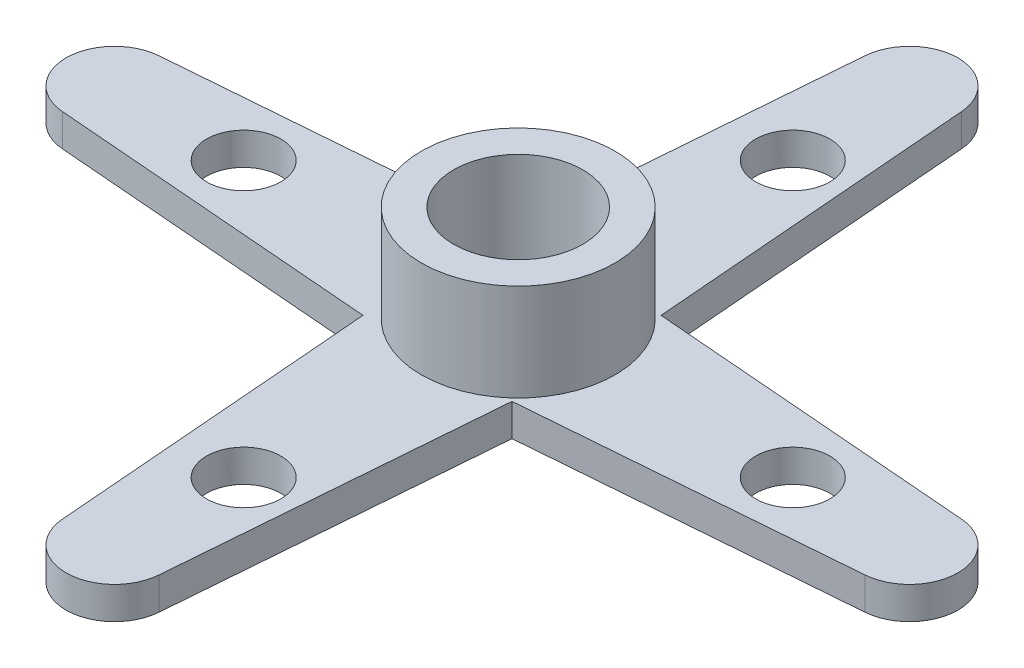
ISO-10303-21;
HEADER;
FILE_DESCRIPTION(('STEP AP214'),'2;1');
FILE_NAME('part.step','',(''),(''),'','','');
FILE_SCHEMA(('AUTOMOTIVE_DESIGN { 1 0 10303 214 1 1 1 1 }'));
ENDSEC;
DATA;
#1=APPLICATION_CONTEXT('core data for automotive mechanical design processes');
#2=APPLICATION_PROTOCOL_DEFINITION('international standard','automotive_design',2000,#1);
#3=PRODUCT_CONTEXT('',#1,'mechanical');
#4=PRODUCT('Part','Part','',(#3));
#5=PRODUCT_RELATED_PRODUCT_CATEGORY('part','',(#4));
#6=PRODUCT_DEFINITION_FORMATION('','',#4);
#7=PRODUCT_DEFINITION_CONTEXT('part definition',#1,'design');
#8=PRODUCT_DEFINITION('design','',#6,#7);
#9=PRODUCT_DEFINITION_SHAPE('','',#8);
#10=(LENGTH_UNIT() NAMED_UNIT(*) SI_UNIT(.MILLI.,.METRE.));
#11=(NAMED_UNIT(*) PLANE_ANGLE_UNIT() SI_UNIT($,.RADIAN.));
#12=(NAMED_UNIT(*) SI_UNIT($,.STERADIAN.) SOLID_ANGLE_UNIT());
#13=UNCERTAINTY_MEASURE_WITH_UNIT(LENGTH_MEASURE(1.E-05),#10,'distance_accuracy_value','');
#14=(GEOMETRIC_REPRESENTATION_CONTEXT(3) GLOBAL_UNCERTAINTY_ASSIGNED_CONTEXT((#13)) GLOBAL_UNIT_ASSIGNED_CONTEXT((#10,
#11,#12)) REPRESENTATION_CONTEXT('',''));
#15=CARTESIAN_POINT('',(0.,0.,0.));
#16=DIRECTION('',(0.,0.,1.));
#17=DIRECTION('',(1.,0.,0.));
#18=AXIS2_PLACEMENT_3D('',#15,#16,#17);
#19=CARTESIAN_POINT('',(-12.5,1.,0.));
#20=DIRECTION('',(0.,1.,0.));
#21=DIRECTION('',(0.,0.,1.));
#22=AXIS2_PLACEMENT_3D('',#19,#20,#21);
#23=PLANE('',#22);
#24=CARTESIAN_POINT('',(0.,1.,8.5));
#25=DIRECTION('',(0.,1.,0.));
#26=DIRECTION('',(-1.,0.,0.));
#27=AXIS2_PLACEMENT_3D('',#24,#25,#26);
#28=CIRCLE('',#27,1.15);
#29=CARTESIAN_POINT('',(-1.15000000000003,1.,8.5));
#30=VERTEX_POINT('',#29);
#31=EDGE_CURVE('E228',#30,#30,#28,.T.);
#32=ORIENTED_EDGE('',*,*,#31,.F.);
#33=EDGE_LOOP('',(#32));
#34=FACE_BOUND('',#33,.T.);
#35=CARTESIAN_POINT('',(0.,1.,-8.5));
#36=DIRECTION('',(0.,1.,0.));
#37=DIRECTION('',(-1.,0.,0.));
#38=AXIS2_PLACEMENT_3D('',#35,#36,#37);
#39=CIRCLE('',#38,1.15);
#40=CARTESIAN_POINT('',(-1.14999999999997,1.,-8.5));
#41=VERTEX_POINT('',#40);
#42=EDGE_CURVE('E217',#41,#41,#39,.T.);
#43=ORIENTED_EDGE('',*,*,#42,.F.);
#44=EDGE_LOOP('',(#43));
#45=FACE_BOUND('',#44,.T.);
#46=CARTESIAN_POINT('',(-12.5,1.,0.));
#47=DIRECTION('',(0.,1.,0.));
#48=DIRECTION('',(0.,0.,1.));
#49=AXIS2_PLACEMENT_3D('',#46,#47,#48);
#50=CIRCLE('',#49,1.5);
#51=CARTESIAN_POINT('',(-12.62,1.,-1.49519229532525));
#52=VERTEX_POINT('',#51);
#53=CARTESIAN_POINT('',(-12.62,1.,1.49519229532525));
#54=VERTEX_POINT('',#53);
#55=EDGE_CURVE('E183',#52,#54,#50,.T.);
#56=ORIENTED_EDGE('',*,*,#55,.T.);
#57=DIRECTION('',(0.996794863550168,0.,0.0800000000000099));
#58=VECTOR('',#57,1.);
#59=CARTESIAN_POINT('',(-12.62,1.,1.49519229532525));
#60=LINE('',#59,#58);
#61=CARTESIAN_POINT('',(-2.50000000000066,1.,2.30739551747729));
#62=VERTEX_POINT('',#61);
#63=EDGE_CURVE('E111',#54,#62,#60,.T.);
#64=ORIENTED_EDGE('',*,*,#63,.T.);
#65=DIRECTION('',(0.0800000000000088,0.,0.996794863550168));
#66=VECTOR('',#65,1.);
#67=CARTESIAN_POINT('',(-1.68779677784863,1.,12.4273955174766));
#68=LINE('',#67,#66);
#69=CARTESIAN_POINT('',(-1.68779677784863,1.,12.4273955174766));
#70=VERTEX_POINT('',#69);
#71=EDGE_CURVE('E244',#62,#70,#68,.T.);
#72=ORIENTED_EDGE('',*,*,#71,.T.);
#73=CARTESIAN_POINT('',(-0.192604482523366,1.,12.3073955174766));
#74=DIRECTION('',(0.,1.,0.));
#75=DIRECTION('',(0.,0.,1.));
#76=AXIS2_PLACEMENT_3D('',#73,#74,#75);
#77=CIRCLE('',#76,1.50000000000002);
#78=CARTESIAN_POINT('',(1.30258781280191,1.,12.4273955174766));
#79=VERTEX_POINT('',#78);
#80=EDGE_CURVE('E246',#70,#79,#77,.T.);
#81=ORIENTED_EDGE('',*,*,#80,.T.);
#82=DIRECTION('',(0.0800000000000076,0.,-0.996794863550168));
#83=VECTOR('',#82,1.);
#84=CARTESIAN_POINT('',(1.30258781280191,1.,12.4273955174766));
#85=LINE('',#84,#83);
#86=CARTESIAN_POINT('',(2.11479103495392,1.,2.30739551747729));
#87=VERTEX_POINT('',#86);
#88=EDGE_CURVE('E248',#79,#87,#85,.T.);
#89=ORIENTED_EDGE('',*,*,#88,.T.);
#90=DIRECTION('',(0.996794863550168,0.,-0.0800000000000086));
#91=VECTOR('',#90,1.);
#92=CARTESIAN_POINT('',(12.2347910349533,1.,1.49519229532526));
#93=LINE('',#92,#91);
#94=CARTESIAN_POINT('',(12.2347910349533,1.,1.49519229532527));
#95=VERTEX_POINT('',#94);
#96=EDGE_CURVE('E250',#87,#95,#93,.T.);
#97=ORIENTED_EDGE('',*,*,#96,.T.);
#98=CARTESIAN_POINT('',(12.1147910349533,1.,0.));
#99=DIRECTION('',(0.,1.,0.));
#100=DIRECTION('',(0.,0.,1.));
#101=AXIS2_PLACEMENT_3D('',#98,#99,#100);
#102=CIRCLE('',#101,1.50000000000002);
#103=CARTESIAN_POINT('',(12.2347910349533,1.,-1.49519229532528));
#104=VERTEX_POINT('',#103);
#105=EDGE_CURVE('E252',#95,#104,#102,.T.);
#106=ORIENTED_EDGE('',*,*,#105,.T.);
#107=DIRECTION('',(-0.996794863550168,0.,-0.0800000000000077));
#108=VECTOR('',#107,1.);
#109=CARTESIAN_POINT('',(12.2347910349533,1.,-1.49519229532528));
#110=LINE('',#109,#108);
#111=CARTESIAN_POINT('',(2.11479103495392,1.,-2.30739551747729));
#112=VERTEX_POINT('',#111);
#113=EDGE_CURVE('E254',#104,#112,#110,.T.);
#114=ORIENTED_EDGE('',*,*,#113,.T.);
#115=DIRECTION('',(-0.0800000000000085,0.,-0.996794863550168));
#116=VECTOR('',#115,1.);
#117=CARTESIAN_POINT('',(1.30258781280189,1.,-12.4273955174766));
#118=LINE('',#117,#116);
#119=CARTESIAN_POINT('',(1.3025878128019,1.,-12.4273955174766));
#120=VERTEX_POINT('',#119);
#121=EDGE_CURVE('E142',#112,#120,#118,.T.);
#122=ORIENTED_EDGE('',*,*,#121,.T.);
#123=CARTESIAN_POINT('',(-0.19260448252337,1.,-12.3073955174766));
#124=DIRECTION('',(0.,1.,0.));
#125=DIRECTION('',(0.,0.,1.));
#126=AXIS2_PLACEMENT_3D('',#123,#124,#125);
#127=CIRCLE('',#126,1.50000000000002);
#128=CARTESIAN_POINT('',(-1.68779677784864,1.,-12.4273955174766));
#129=VERTEX_POINT('',#128);
#130=EDGE_CURVE('E136',#120,#129,#127,.T.);
#131=ORIENTED_EDGE('',*,*,#130,.T.);
#132=DIRECTION('',(-0.0800000000000077,0.,0.996794863550168));
#133=VECTOR('',#132,1.);
#134=CARTESIAN_POINT('',(-1.68779677784864,1.,-12.4273955174766));
#135=LINE('',#134,#133);
#136=CARTESIAN_POINT('',(-2.50000000000066,1.,-2.30739551747729));
#137=VERTEX_POINT('',#136);
#138=EDGE_CURVE('E140',#129,#137,#135,.T.);
#139=ORIENTED_EDGE('',*,*,#138,.T.);
#140=DIRECTION('',(-0.996794863550168,0.,0.0800000000000097));
#141=VECTOR('',#140,1.);
#142=CARTESIAN_POINT('',(-12.62,1.,-1.49519229532525));
#143=LINE('',#142,#141);
#144=EDGE_CURVE('E56',#137,#52,#143,.T.);
#145=ORIENTED_EDGE('',*,*,#144,.T.);
#146=EDGE_LOOP('',(#56,#64,#72,#81,#89,#97,#106,#114,#122,#131,#139,#145));
#147=FACE_BOUND('',#146,.T.);
#148=CARTESIAN_POINT('',(-8.5,1.,0.));
#149=DIRECTION('',(0.,1.,0.));
#150=DIRECTION('',(0.,0.,1.));
#151=AXIS2_PLACEMENT_3D('',#148,#149,#150);
#152=CIRCLE('',#151,1.15);
#153=CARTESIAN_POINT('',(-8.5,1.,1.15));
#154=VERTEX_POINT('',#153);
#155=EDGE_CURVE('E210',#154,#154,#152,.T.);
#156=ORIENTED_EDGE('',*,*,#155,.F.);
#157=EDGE_LOOP('',(#156));
#158=FACE_BOUND('',#157,.T.);
#159=CARTESIAN_POINT('',(8.5,1.,0.));
#160=DIRECTION('',(0.,1.,0.));
#161=DIRECTION('',(0.,0.,1.));
#162=AXIS2_PLACEMENT_3D('',#159,#160,#161);
#163=CIRCLE('',#162,1.15);
#164=CARTESIAN_POINT('',(8.5,1.,1.15));
#165=VERTEX_POINT('',#164);
#166=EDGE_CURVE('E213',#165,#165,#163,.T.);
#167=ORIENTED_EDGE('',*,*,#166,.F.);
#168=EDGE_LOOP('',(#167));
#169=FACE_BOUND('',#168,.T.);
#170=CARTESIAN_POINT('',(0.,1.,0.));
#171=DIRECTION('',(0.,1.,0.));
#172=DIRECTION('',(0.,0.,1.));
#173=AXIS2_PLACEMENT_3D('',#170,#171,#172);
#174=CIRCLE('',#173,3.);
#175=CARTESIAN_POINT('',(0.,1.,3.));
#176=VERTEX_POINT('',#175);
#177=EDGE_CURVE('E221',#176,#176,#174,.T.);
#178=ORIENTED_EDGE('',*,*,#177,.F.);
#179=EDGE_LOOP('',(#178));
#180=FACE_BOUND('',#179,.T.);
#181=ADVANCED_FACE('F37',(#34,#45,#147,#158,#169,#180),#23,.T.);
#182=CARTESIAN_POINT('',(-12.5,0.,0.));
#183=DIRECTION('',(0.,1.,0.));
#184=DIRECTION('',(0.,0.,1.));
#185=AXIS2_PLACEMENT_3D('',#182,#183,#184);
#186=PLANE('',#185);
#187=CARTESIAN_POINT('',(0.,0.,8.5));
#188=DIRECTION('',(0.,1.,0.));
#189=DIRECTION('',(0.,0.,1.));
#190=AXIS2_PLACEMENT_3D('',#187,#188,#189);
#191=CIRCLE('',#190,1.15);
#192=CARTESIAN_POINT('',(0.,0.,9.65));
#193=VERTEX_POINT('',#192);
#194=EDGE_CURVE('E41',#193,#193,#191,.T.);
#195=ORIENTED_EDGE('',*,*,#194,.T.);
#196=EDGE_LOOP('',(#195));
#197=FACE_BOUND('',#196,.T.);
#198=CARTESIAN_POINT('',(0.,0.,-8.5));
#199=DIRECTION('',(0.,1.,0.));
#200=DIRECTION('',(0.,0.,1.));
#201=AXIS2_PLACEMENT_3D('',#198,#199,#200);
#202=CIRCLE('',#201,1.15);
#203=CARTESIAN_POINT('',(0.,0.,-7.35));
#204=VERTEX_POINT('',#203);
#205=EDGE_CURVE('E214',#204,#204,#202,.T.);
#206=ORIENTED_EDGE('',*,*,#205,.T.);
#207=EDGE_LOOP('',(#206));
#208=FACE_BOUND('',#207,.T.);
#209=CARTESIAN_POINT('',(8.5,0.,0.));
#210=DIRECTION('',(0.,1.,0.));
#211=DIRECTION('',(0.,0.,1.));
#212=AXIS2_PLACEMENT_3D('',#209,#210,#211);
#213=CIRCLE('',#212,1.15);
#214=CARTESIAN_POINT('',(8.5,0.,1.15));
#215=VERTEX_POINT('',#214);
#216=EDGE_CURVE('E211',#215,#215,#213,.T.);
#217=ORIENTED_EDGE('',*,*,#216,.T.);
#218=EDGE_LOOP('',(#217));
#219=FACE_BOUND('',#218,.T.);
#220=CARTESIAN_POINT('',(-8.5,0.,0.));
#221=DIRECTION('',(0.,1.,0.));
#222=DIRECTION('',(0.,0.,1.));
#223=AXIS2_PLACEMENT_3D('',#220,#221,#222);
#224=CIRCLE('',#223,1.15);
#225=CARTESIAN_POINT('',(-8.5,0.,1.15));
#226=VERTEX_POINT('',#225);
#227=EDGE_CURVE('E207',#226,#226,#224,.T.);
#228=ORIENTED_EDGE('',*,*,#227,.T.);
#229=EDGE_LOOP('',(#228));
#230=FACE_BOUND('',#229,.T.);
#231=CARTESIAN_POINT('',(-12.5,0.,0.));
#232=DIRECTION('',(0.,1.,0.));
#233=DIRECTION('',(0.,0.,1.));
#234=AXIS2_PLACEMENT_3D('',#231,#232,#233);
#235=CIRCLE('',#234,1.5);
#236=CARTESIAN_POINT('',(-12.62,0.,-1.49519229532525));
#237=VERTEX_POINT('',#236);
#238=CARTESIAN_POINT('',(-12.62,0.,1.49519229532525));
#239=VERTEX_POINT('',#238);
#240=EDGE_CURVE('E160',#237,#239,#235,.T.);
#241=ORIENTED_EDGE('',*,*,#240,.F.);
#242=DIRECTION('',(-0.996794863550168,0.,0.0800000000000097));
#243=VECTOR('',#242,1.);
#244=CARTESIAN_POINT('',(-12.62,0.,-1.49519229532525));
#245=LINE('',#244,#243);
#246=CARTESIAN_POINT('',(-2.50000000000066,0.,-2.30739551747729));
#247=VERTEX_POINT('',#246);
#248=EDGE_CURVE('E103',#247,#237,#245,.T.);
#249=ORIENTED_EDGE('',*,*,#248,.F.);
#250=DIRECTION('',(-0.0800000000000077,0.,0.996794863550168));
#251=VECTOR('',#250,1.);
#252=CARTESIAN_POINT('',(-1.68779677784864,0.,-12.4273955174766));
#253=LINE('',#252,#251);
#254=CARTESIAN_POINT('',(-1.68779677784864,0.,-12.4273955174766));
#255=VERTEX_POINT('',#254);
#256=EDGE_CURVE('E97',#255,#247,#253,.T.);
#257=ORIENTED_EDGE('',*,*,#256,.F.);
#258=CARTESIAN_POINT('',(-0.19260448252337,0.,-12.3073955174766));
#259=DIRECTION('',(0.,1.,0.));
#260=DIRECTION('',(0.,0.,1.));
#261=AXIS2_PLACEMENT_3D('',#258,#259,#260);
#262=CIRCLE('',#261,1.50000000000002);
#263=CARTESIAN_POINT('',(1.3025878128019,0.,-12.4273955174766));
#264=VERTEX_POINT('',#263);
#265=EDGE_CURVE('E150',#264,#255,#262,.T.);
#266=ORIENTED_EDGE('',*,*,#265,.F.);
#267=DIRECTION('',(-0.0800000000000085,0.,-0.996794863550168));
#268=VECTOR('',#267,1.);
#269=CARTESIAN_POINT('',(1.30258781280189,0.,-12.4273955174766));
#270=LINE('',#269,#268);
#271=CARTESIAN_POINT('',(2.11479103495392,0.,-2.30739551747729));
#272=VERTEX_POINT('',#271);
#273=EDGE_CURVE('E178',#272,#264,#270,.T.);
#274=ORIENTED_EDGE('',*,*,#273,.F.);
#275=DIRECTION('',(-0.996794863550168,0.,-0.0800000000000077));
#276=VECTOR('',#275,1.);
#277=CARTESIAN_POINT('',(12.2347910349533,0.,-1.49519229532528));
#278=LINE('',#277,#276);
#279=CARTESIAN_POINT('',(12.2347910349533,0.,-1.49519229532528));
#280=VERTEX_POINT('',#279);
#281=EDGE_CURVE('E176',#280,#272,#278,.T.);
#282=ORIENTED_EDGE('',*,*,#281,.F.);
#283=CARTESIAN_POINT('',(12.1147910349533,0.,0.));
#284=DIRECTION('',(0.,1.,0.));
#285=DIRECTION('',(0.,0.,1.));
#286=AXIS2_PLACEMENT_3D('',#283,#284,#285);
#287=CIRCLE('',#286,1.50000000000002);
#288=CARTESIAN_POINT('',(12.2347910349533,0.,1.49519229532527));
#289=VERTEX_POINT('',#288);
#290=EDGE_CURVE('E174',#289,#280,#287,.T.);
#291=ORIENTED_EDGE('',*,*,#290,.F.);
#292=DIRECTION('',(0.996794863550168,0.,-0.0800000000000086));
#293=VECTOR('',#292,1.);
#294=CARTESIAN_POINT('',(12.2347910349533,0.,1.49519229532526));
#295=LINE('',#294,#293);
#296=CARTESIAN_POINT('',(2.11479103495392,0.,2.30739551747729));
#297=VERTEX_POINT('',#296);
#298=EDGE_CURVE('E172',#297,#289,#295,.T.);
#299=ORIENTED_EDGE('',*,*,#298,.F.);
#300=DIRECTION('',(0.0800000000000076,0.,-0.996794863550168));
#301=VECTOR('',#300,1.);
#302=CARTESIAN_POINT('',(1.30258781280191,0.,12.4273955174766));
#303=LINE('',#302,#301);
#304=CARTESIAN_POINT('',(1.30258781280191,0.,12.4273955174766));
#305=VERTEX_POINT('',#304);
#306=EDGE_CURVE('E170',#305,#297,#303,.T.);
#307=ORIENTED_EDGE('',*,*,#306,.F.);
#308=CARTESIAN_POINT('',(-0.192604482523366,0.,12.3073955174766));
#309=DIRECTION('',(0.,1.,0.));
#310=DIRECTION('',(0.,0.,1.));
#311=AXIS2_PLACEMENT_3D('',#308,#309,#310);
#312=CIRCLE('',#311,1.50000000000002);
#313=CARTESIAN_POINT('',(-1.68779677784863,0.,12.4273955174766));
#314=VERTEX_POINT('',#313);
#315=EDGE_CURVE('E168',#314,#305,#312,.T.);
#316=ORIENTED_EDGE('',*,*,#315,.F.);
#317=DIRECTION('',(0.0800000000000088,0.,0.996794863550168));
#318=VECTOR('',#317,1.);
#319=CARTESIAN_POINT('',(-1.68779677784863,0.,12.4273955174766));
#320=LINE('',#319,#318);
#321=CARTESIAN_POINT('',(-2.50000000000066,0.,2.30739551747729));
#322=VERTEX_POINT('',#321);
#323=EDGE_CURVE('E166',#322,#314,#320,.T.);
#324=ORIENTED_EDGE('',*,*,#323,.F.);
#325=DIRECTION('',(0.996794863550168,0.,0.0800000000000099));
#326=VECTOR('',#325,1.);
#327=CARTESIAN_POINT('',(-12.62,0.,1.49519229532525));
#328=LINE('',#327,#326);
#329=EDGE_CURVE('E163',#239,#322,#328,.T.);
#330=ORIENTED_EDGE('',*,*,#329,.F.);
#331=EDGE_LOOP('',(#241,#249,#257,#266,#274,#282,#291,#299,#307,#316,#324,#330));
#332=FACE_BOUND('',#331,.T.);
#333=CARTESIAN_POINT('',(0.,0.,0.));
#334=DIRECTION('',(0.,1.,0.));
#335=DIRECTION('',(0.,0.,1.));
#336=AXIS2_PLACEMENT_3D('',#333,#334,#335);
#337=CIRCLE('',#336,2.);
#338=CARTESIAN_POINT('',(0.,0.,2.));
#339=VERTEX_POINT('',#338);
#340=EDGE_CURVE('E164',#339,#339,#337,.T.);
#341=ORIENTED_EDGE('',*,*,#340,.T.);
#342=EDGE_LOOP('',(#341));
#343=FACE_BOUND('',#342,.T.);
#344=ADVANCED_FACE('F267',(#197,#208,#219,#230,#332,#343),#186,.F.);
#345=CARTESIAN_POINT('',(-12.5,1.,0.));
#346=DIRECTION('',(0.,-1.,0.));
#347=DIRECTION('',(0.,0.,-1.));
#348=AXIS2_PLACEMENT_3D('',#345,#346,#347);
#349=CYLINDRICAL_SURFACE('',#348,1.5);
#350=ORIENTED_EDGE('',*,*,#240,.T.);
#351=DIRECTION('',(0.,-1.,0.));
#352=VECTOR('',#351,1.);
#353=CARTESIAN_POINT('',(-12.62,1.,1.49519229532525));
#354=LINE('',#353,#352);
#355=EDGE_CURVE('E11',#54,#239,#354,.T.);
#356=ORIENTED_EDGE('',*,*,#355,.F.);
#357=ORIENTED_EDGE('',*,*,#55,.F.);
#358=DIRECTION('',(0.,-1.,0.));
#359=VECTOR('',#358,1.);
#360=CARTESIAN_POINT('',(-12.62,1.,-1.49519229532525));
#361=LINE('',#360,#359);
#362=EDGE_CURVE('E156',#52,#237,#361,.T.);
#363=ORIENTED_EDGE('',*,*,#362,.T.);
#364=EDGE_LOOP('',(#350,#356,#357,#363));
#365=FACE_BOUND('',#364,.T.);
#366=ADVANCED_FACE('F39',(#365),#349,.T.);
#367=CARTESIAN_POINT('',(-12.62,1.,1.49519229532525));
#368=DIRECTION('',(0.0800000000000099,0.,-0.996794863550168));
#369=DIRECTION('',(-0.996794863550168,0.,-0.0800000000000099));
#370=AXIS2_PLACEMENT_3D('',#367,#368,#369);
#371=PLANE('',#370);
#372=ORIENTED_EDGE('',*,*,#329,.T.);
#373=DIRECTION('',(0.,-1.,0.));
#374=VECTOR('',#373,1.);
#375=CARTESIAN_POINT('',(-2.50000000000066,1.,2.30739551747729));
#376=LINE('',#375,#374);
#377=EDGE_CURVE('E47',#62,#322,#376,.T.);
#378=ORIENTED_EDGE('',*,*,#377,.F.);
#379=ORIENTED_EDGE('',*,*,#63,.F.);
#380=ORIENTED_EDGE('',*,*,#355,.T.);
#381=EDGE_LOOP('',(#372,#378,#379,#380));
#382=FACE_BOUND('',#381,.T.);
#383=ADVANCED_FACE('F387',(#382),#371,.F.);
#384=CARTESIAN_POINT('',(-1.68779677784863,1.,12.4273955174766));
#385=DIRECTION('',(0.996794863550168,0.,-0.0800000000000088));
#386=DIRECTION('',(-0.0800000000000088,0.,-0.996794863550168));
#387=AXIS2_PLACEMENT_3D('',#384,#385,#386);
#388=PLANE('',#387);
#389=ORIENTED_EDGE('',*,*,#323,.T.);
#390=DIRECTION('',(0.,-1.,0.));
#391=VECTOR('',#390,1.);
#392=CARTESIAN_POINT('',(-1.68779677784863,1.,12.4273955174766));
#393=LINE('',#392,#391);
#394=EDGE_CURVE('E202',#70,#314,#393,.T.);
#395=ORIENTED_EDGE('',*,*,#394,.F.);
#396=ORIENTED_EDGE('',*,*,#71,.F.);
#397=ORIENTED_EDGE('',*,*,#377,.T.);
#398=EDGE_LOOP('',(#389,#395,#396,#397));
#399=FACE_BOUND('',#398,.T.);
#400=ADVANCED_FACE('F392',(#399),#388,.F.);
#401=CARTESIAN_POINT('',(-0.192604482523366,1.,12.3073955174766));
#402=DIRECTION('',(0.,-1.,0.));
#403=DIRECTION('',(0.,0.,-1.));
#404=AXIS2_PLACEMENT_3D('',#401,#402,#403);
#405=CYLINDRICAL_SURFACE('',#404,1.50000000000002);
#406=ORIENTED_EDGE('',*,*,#315,.T.);
#407=DIRECTION('',(0.,-1.,0.));
#408=VECTOR('',#407,1.);
#409=CARTESIAN_POINT('',(1.30258781280191,1.,12.4273955174766));
#410=LINE('',#409,#408);
#411=EDGE_CURVE('E199',#79,#305,#410,.T.);
#412=ORIENTED_EDGE('',*,*,#411,.F.);
#413=ORIENTED_EDGE('',*,*,#80,.F.);
#414=ORIENTED_EDGE('',*,*,#394,.T.);
#415=EDGE_LOOP('',(#406,#412,#413,#414));
#416=FACE_BOUND('',#415,.T.);
#417=ADVANCED_FACE('F398',(#416),#405,.T.);
#418=CARTESIAN_POINT('',(1.30258781280191,1.,12.4273955174766));
#419=DIRECTION('',(-0.996794863550169,0.,-0.0800000000000076));
#420=DIRECTION('',(-0.0800000000000076,0.,0.996794863550168));
#421=AXIS2_PLACEMENT_3D('',#418,#419,#420);
#422=PLANE('',#421);
#423=ORIENTED_EDGE('',*,*,#306,.T.);
#424=DIRECTION('',(0.,-1.,0.));
#425=VECTOR('',#424,1.);
#426=CARTESIAN_POINT('',(2.11479103495392,1.,2.30739551747729));
#427=LINE('',#426,#425);
#428=EDGE_CURVE('E196',#87,#297,#427,.T.);
#429=ORIENTED_EDGE('',*,*,#428,.F.);
#430=ORIENTED_EDGE('',*,*,#88,.F.);
#431=ORIENTED_EDGE('',*,*,#411,.T.);
#432=EDGE_LOOP('',(#423,#429,#430,#431));
#433=FACE_BOUND('',#432,.T.);
#434=ADVANCED_FACE('F406',(#433),#422,.F.);
#435=CARTESIAN_POINT('',(12.2347910349533,1.,1.49519229532526));
#436=DIRECTION('',(-0.0800000000000086,0.,-0.996794863550168));
#437=DIRECTION('',(-0.996794863550168,0.,0.0800000000000086));
#438=AXIS2_PLACEMENT_3D('',#435,#436,#437);
#439=PLANE('',#438);
#440=ORIENTED_EDGE('',*,*,#298,.T.);
#441=DIRECTION('',(0.,-1.,0.));
#442=VECTOR('',#441,1.);
#443=CARTESIAN_POINT('',(12.2347910349533,1.,1.49519229532527));
#444=LINE('',#443,#442);
#445=EDGE_CURVE('E193',#95,#289,#444,.T.);
#446=ORIENTED_EDGE('',*,*,#445,.F.);
#447=ORIENTED_EDGE('',*,*,#96,.F.);
#448=ORIENTED_EDGE('',*,*,#428,.T.);
#449=EDGE_LOOP('',(#440,#446,#447,#448));
#450=FACE_BOUND('',#449,.T.);
#451=ADVANCED_FACE('F414',(#450),#439,.F.);
#452=CARTESIAN_POINT('',(12.1147910349533,1.,0.));
#453=DIRECTION('',(0.,-1.,0.));
#454=DIRECTION('',(0.,0.,-1.));
#455=AXIS2_PLACEMENT_3D('',#452,#453,#454);
#456=CYLINDRICAL_SURFACE('',#455,1.50000000000002);
#457=ORIENTED_EDGE('',*,*,#290,.T.);
#458=DIRECTION('',(0.,-1.,0.));
#459=VECTOR('',#458,1.);
#460=CARTESIAN_POINT('',(12.2347910349533,1.,-1.49519229532528));
#461=LINE('',#460,#459);
#462=EDGE_CURVE('E190',#104,#280,#461,.T.);
#463=ORIENTED_EDGE('',*,*,#462,.F.);
#464=ORIENTED_EDGE('',*,*,#105,.F.);
#465=ORIENTED_EDGE('',*,*,#445,.T.);
#466=EDGE_LOOP('',(#457,#463,#464,#465));
#467=FACE_BOUND('',#466,.T.);
#468=ADVANCED_FACE('F422',(#467),#456,.T.);
#469=CARTESIAN_POINT('',(12.2347910349533,1.,-1.49519229532528));
#470=DIRECTION('',(-0.0800000000000077,0.,0.996794863550168));
#471=DIRECTION('',(0.996794863550169,0.,0.0800000000000077));
#472=AXIS2_PLACEMENT_3D('',#469,#470,#471);
#473=PLANE('',#472);
#474=ORIENTED_EDGE('',*,*,#281,.T.);
#475=DIRECTION('',(0.,-1.,0.));
#476=VECTOR('',#475,1.);
#477=CARTESIAN_POINT('',(2.11479103495392,1.,-2.30739551747729));
#478=LINE('',#477,#476);
#479=EDGE_CURVE('E187',#112,#272,#478,.T.);
#480=ORIENTED_EDGE('',*,*,#479,.F.);
#481=ORIENTED_EDGE('',*,*,#113,.F.);
#482=ORIENTED_EDGE('',*,*,#462,.T.);
#483=EDGE_LOOP('',(#474,#480,#481,#482));
#484=FACE_BOUND('',#483,.T.);
#485=ADVANCED_FACE('F260',(#484),#473,.F.);
#486=CARTESIAN_POINT('',(1.30258781280189,1.,-12.4273955174766));
#487=DIRECTION('',(-0.996794863550168,0.,0.0800000000000085));
#488=DIRECTION('',(0.0800000000000085,0.,0.996794863550168));
#489=AXIS2_PLACEMENT_3D('',#486,#487,#488);
#490=PLANE('',#489);
#491=ORIENTED_EDGE('',*,*,#273,.T.);
#492=DIRECTION('',(0.,-1.,0.));
#493=VECTOR('',#492,1.);
#494=CARTESIAN_POINT('',(1.3025878128019,1.,-12.4273955174766));
#495=LINE('',#494,#493);
#496=EDGE_CURVE('E151',#120,#264,#495,.T.);
#497=ORIENTED_EDGE('',*,*,#496,.F.);
#498=ORIENTED_EDGE('',*,*,#121,.F.);
#499=ORIENTED_EDGE('',*,*,#479,.T.);
#500=EDGE_LOOP('',(#491,#497,#498,#499));
#501=FACE_BOUND('',#500,.T.);
#502=ADVANCED_FACE('F264',(#501),#490,.F.);
#503=CARTESIAN_POINT('',(-0.19260448252337,1.,-12.3073955174766));
#504=DIRECTION('',(0.,-1.,0.));
#505=DIRECTION('',(0.,0.,-1.));
#506=AXIS2_PLACEMENT_3D('',#503,#504,#505);
#507=CYLINDRICAL_SURFACE('',#506,1.50000000000002);
#508=ORIENTED_EDGE('',*,*,#265,.T.);
#509=DIRECTION('',(0.,-1.,0.));
#510=VECTOR('',#509,1.);
#511=CARTESIAN_POINT('',(-1.68779677784864,1.,-12.4273955174766));
#512=LINE('',#511,#510);
#513=EDGE_CURVE('E147',#129,#255,#512,.T.);
#514=ORIENTED_EDGE('',*,*,#513,.F.);
#515=ORIENTED_EDGE('',*,*,#130,.F.);
#516=ORIENTED_EDGE('',*,*,#496,.T.);
#517=EDGE_LOOP('',(#508,#514,#515,#516));
#518=FACE_BOUND('',#517,.T.);
#519=ADVANCED_FACE('F148',(#518),#507,.T.);
#520=CARTESIAN_POINT('',(-1.68779677784864,1.,-12.4273955174766));
#521=DIRECTION('',(0.996794863550168,0.,0.0800000000000077));
#522=DIRECTION('',(0.0800000000000077,0.,-0.996794863550169));
#523=AXIS2_PLACEMENT_3D('',#520,#521,#522);
#524=PLANE('',#523);
#525=ORIENTED_EDGE('',*,*,#256,.T.);
#526=DIRECTION('',(0.,-1.,0.));
#527=VECTOR('',#526,1.);
#528=CARTESIAN_POINT('',(-2.50000000000066,1.,-2.30739551747729));
#529=LINE('',#528,#527);
#530=EDGE_CURVE('E152',#137,#247,#529,.T.);
#531=ORIENTED_EDGE('',*,*,#530,.F.);
#532=ORIENTED_EDGE('',*,*,#138,.F.);
#533=ORIENTED_EDGE('',*,*,#513,.T.);
#534=EDGE_LOOP('',(#525,#531,#532,#533));
#535=FACE_BOUND('',#534,.T.);
#536=ADVANCED_FACE('F154',(#535),#524,.F.);
#537=CARTESIAN_POINT('',(-12.62,1.,-1.49519229532525));
#538=DIRECTION('',(0.0800000000000097,0.,0.996794863550168));
#539=DIRECTION('',(0.996794863550168,0.,-0.0800000000000097));
#540=AXIS2_PLACEMENT_3D('',#537,#538,#539);
#541=PLANE('',#540);
#542=ORIENTED_EDGE('',*,*,#248,.T.);
#543=ORIENTED_EDGE('',*,*,#362,.F.);
#544=ORIENTED_EDGE('',*,*,#144,.F.);
#545=ORIENTED_EDGE('',*,*,#530,.T.);
#546=EDGE_LOOP('',(#542,#543,#544,#545));
#547=FACE_BOUND('',#546,.T.);
#548=ADVANCED_FACE('F273',(#547),#541,.F.);
#549=CARTESIAN_POINT('',(0.,1.,0.));
#550=DIRECTION('',(0.,-1.,0.));
#551=DIRECTION('',(0.,0.,-1.));
#552=AXIS2_PLACEMENT_3D('',#549,#550,#551);
#553=CYLINDRICAL_SURFACE('',#552,2.);
#554=ORIENTED_EDGE('',*,*,#340,.F.);
#555=EDGE_LOOP('',(#554));
#556=FACE_BOUND('',#555,.T.);
#557=CARTESIAN_POINT('',(0.,4.,0.));
#558=DIRECTION('',(0.,1.,0.));
#559=DIRECTION('',(0.,0.,1.));
#560=AXIS2_PLACEMENT_3D('',#557,#558,#559);
#561=CIRCLE('',#560,2.);
#562=CARTESIAN_POINT('',(0.,4.,2.));
#563=VERTEX_POINT('',#562);
#564=EDGE_CURVE('E216',#563,#563,#561,.T.);
#565=ORIENTED_EDGE('',*,*,#564,.T.);
#566=EDGE_LOOP('',(#565));
#567=FACE_BOUND('',#566,.T.);
#568=ADVANCED_FACE('F275',(#556,#567),#553,.F.);
#569=CARTESIAN_POINT('',(-8.5,-1.,0.));
#570=DIRECTION('',(0.,1.,0.));
#571=DIRECTION('',(0.,0.,1.));
#572=AXIS2_PLACEMENT_3D('',#569,#570,#571);
#573=CYLINDRICAL_SURFACE('',#572,1.15);
#574=ORIENTED_EDGE('',*,*,#155,.T.);
#575=EDGE_LOOP('',(#574));
#576=FACE_BOUND('',#575,.T.);
#577=ORIENTED_EDGE('',*,*,#227,.F.);
#578=EDGE_LOOP('',(#577));
#579=FACE_BOUND('',#578,.T.);
#580=ADVANCED_FACE('F281',(#576,#579),#573,.F.);
#581=CARTESIAN_POINT('',(8.5,-1.,0.));
#582=DIRECTION('',(0.,1.,0.));
#583=DIRECTION('',(0.,0.,1.));
#584=AXIS2_PLACEMENT_3D('',#581,#582,#583);
#585=CYLINDRICAL_SURFACE('',#584,1.15);
#586=ORIENTED_EDGE('',*,*,#166,.T.);
#587=EDGE_LOOP('',(#586));
#588=FACE_BOUND('',#587,.T.);
#589=ORIENTED_EDGE('',*,*,#216,.F.);
#590=EDGE_LOOP('',(#589));
#591=FACE_BOUND('',#590,.T.);
#592=ADVANCED_FACE('F298',(#588,#591),#585,.F.);
#593=CARTESIAN_POINT('',(0.,4.,0.));
#594=DIRECTION('',(0.,1.,0.));
#595=DIRECTION('',(0.,0.,1.));
#596=AXIS2_PLACEMENT_3D('',#593,#594,#595);
#597=PLANE('',#596);
#598=CARTESIAN_POINT('',(0.,4.,0.));
#599=DIRECTION('',(0.,1.,0.));
#600=DIRECTION('',(0.,0.,1.));
#601=AXIS2_PLACEMENT_3D('',#598,#599,#600);
#602=CIRCLE('',#601,3.);
#603=CARTESIAN_POINT('',(0.,4.,3.));
#604=VERTEX_POINT('',#603);
#605=EDGE_CURVE('E231',#604,#604,#602,.T.);
#606=ORIENTED_EDGE('',*,*,#605,.T.);
#607=EDGE_LOOP('',(#606));
#608=FACE_BOUND('',#607,.T.);
#609=ORIENTED_EDGE('',*,*,#564,.F.);
#610=EDGE_LOOP('',(#609));
#611=FACE_BOUND('',#610,.T.);
#612=ADVANCED_FACE('F302',(#608,#611),#597,.T.);
#613=CARTESIAN_POINT('',(0.,4.,0.));
#614=DIRECTION('',(0.,-1.,0.));
#615=DIRECTION('',(0.,0.,-1.));
#616=AXIS2_PLACEMENT_3D('',#613,#614,#615);
#617=CYLINDRICAL_SURFACE('',#616,3.);
#618=ORIENTED_EDGE('',*,*,#605,.F.);
#619=EDGE_LOOP('',(#618));
#620=FACE_BOUND('',#619,.T.);
#621=ORIENTED_EDGE('',*,*,#177,.T.);
#622=EDGE_LOOP('',(#621));
#623=FACE_BOUND('',#622,.T.);
#624=ADVANCED_FACE('F304',(#620,#623),#617,.T.);
#625=CARTESIAN_POINT('',(0.,-1.,-8.5));
#626=DIRECTION('',(0.,1.,0.));
#627=DIRECTION('',(0.,0.,1.));
#628=AXIS2_PLACEMENT_3D('',#625,#626,#627);
#629=CYLINDRICAL_SURFACE('',#628,1.15);
#630=ORIENTED_EDGE('',*,*,#42,.T.);
#631=EDGE_LOOP('',(#630));
#632=FACE_BOUND('',#631,.T.);
#633=ORIENTED_EDGE('',*,*,#205,.F.);
#634=EDGE_LOOP('',(#633));
#635=FACE_BOUND('',#634,.T.);
#636=ADVANCED_FACE('F307',(#632,#635),#629,.F.);
#637=CARTESIAN_POINT('',(0.,-1.,8.5));
#638=DIRECTION('',(0.,1.,0.));
#639=DIRECTION('',(0.,0.,1.));
#640=AXIS2_PLACEMENT_3D('',#637,#638,#639);
#641=CYLINDRICAL_SURFACE('',#640,1.15);
#642=ORIENTED_EDGE('',*,*,#31,.T.);
#643=EDGE_LOOP('',(#642));
#644=FACE_BOUND('',#643,.T.);
#645=ORIENTED_EDGE('',*,*,#194,.F.);
#646=EDGE_LOOP('',(#645));
#647=FACE_BOUND('',#646,.T.);
#648=ADVANCED_FACE('F314',(#644,#647),#641,.F.);
#649=CLOSED_SHELL('',(#181,#344,#366,#383,#400,#417,#434,#451,#468,#485,#502,#519,#536,#548,
#568,#580,#592,#612,#624,#636,#648));
#650=MANIFOLD_SOLID_BREP('B2',#649);
#651=ADVANCED_BREP_SHAPE_REPRESENTATION('',(#18,#650),#14);
#652=SHAPE_DEFINITION_REPRESENTATION(#9,#651);
ENDSEC;
END-ISO-10303-21;
